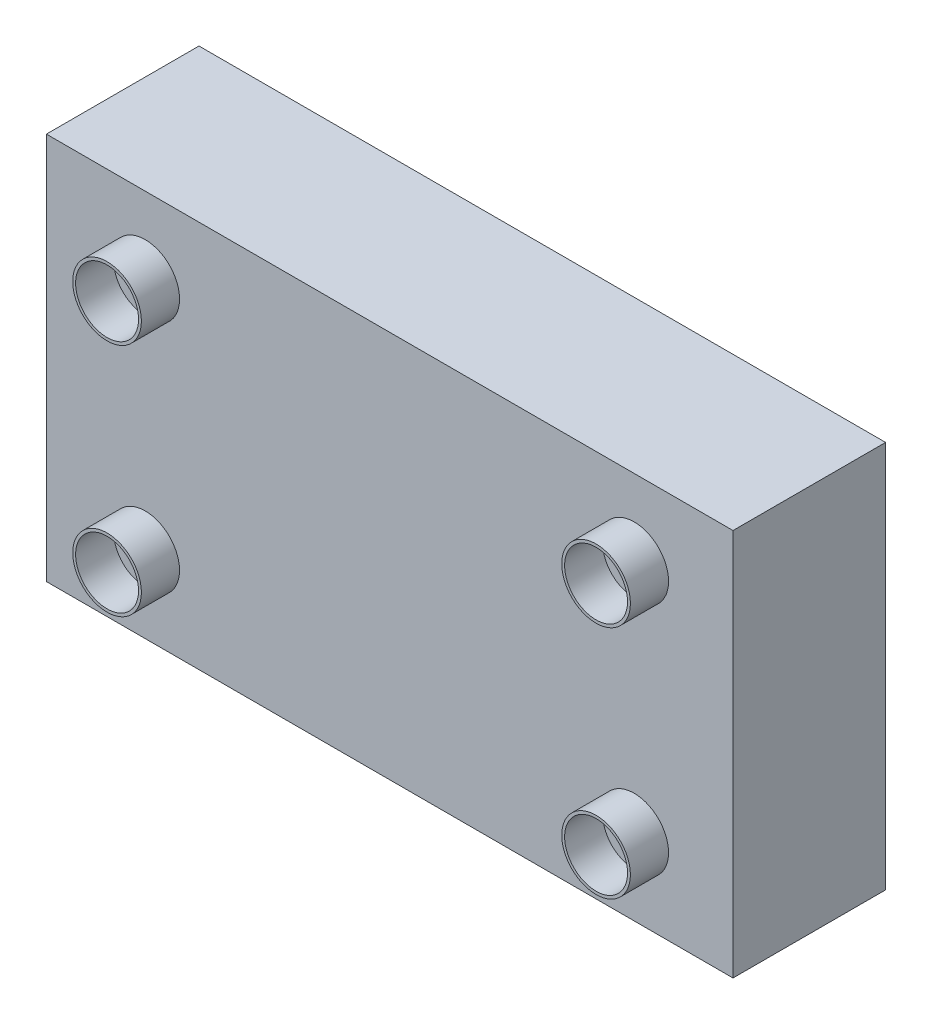
ISO-10303-21;
HEADER;
FILE_DESCRIPTION(('STEP AP214'),'2;1');
FILE_NAME('part.step','',(''),(''),'','','');
FILE_SCHEMA(('AUTOMOTIVE_DESIGN { 1 0 10303 214 1 1 1 1 }'));
ENDSEC;
DATA;
#1=APPLICATION_CONTEXT('core data for automotive mechanical design processes');
#2=APPLICATION_PROTOCOL_DEFINITION('international standard','automotive_design',2000,#1);
#3=PRODUCT_CONTEXT('',#1,'mechanical');
#4=PRODUCT('Part','Part','',(#3));
#5=PRODUCT_RELATED_PRODUCT_CATEGORY('part','',(#4));
#6=PRODUCT_DEFINITION_FORMATION('','',#4);
#7=PRODUCT_DEFINITION_CONTEXT('part definition',#1,'design');
#8=PRODUCT_DEFINITION('design','',#6,#7);
#9=PRODUCT_DEFINITION_SHAPE('','',#8);
#10=(LENGTH_UNIT() NAMED_UNIT(*) SI_UNIT(.MILLI.,.METRE.));
#11=(NAMED_UNIT(*) PLANE_ANGLE_UNIT() SI_UNIT($,.RADIAN.));
#12=(NAMED_UNIT(*) SI_UNIT($,.STERADIAN.) SOLID_ANGLE_UNIT());
#13=UNCERTAINTY_MEASURE_WITH_UNIT(LENGTH_MEASURE(1.E-05),#10,'distance_accuracy_value','');
#14=(GEOMETRIC_REPRESENTATION_CONTEXT(3) GLOBAL_UNCERTAINTY_ASSIGNED_CONTEXT((#13)) GLOBAL_UNIT_ASSIGNED_CONTEXT((#10,
#11,#12)) REPRESENTATION_CONTEXT('',''));
#15=CARTESIAN_POINT('',(0.,0.,0.));
#16=DIRECTION('',(0.,0.,1.));
#17=DIRECTION('',(1.,0.,0.));
#18=AXIS2_PLACEMENT_3D('',#15,#16,#17);
#19=CARTESIAN_POINT('',(-90.,-50.8,40.));
#20=DIRECTION('',(1.,0.,0.));
#21=DIRECTION('',(0.,0.,-1.));
#22=AXIS2_PLACEMENT_3D('',#19,#20,#21);
#23=PLANE('',#22);
#24=DIRECTION('',(0.,-1.,0.));
#25=VECTOR('',#24,1.);
#26=CARTESIAN_POINT('',(-90.,-50.8,0.));
#27=LINE('',#26,#25);
#28=CARTESIAN_POINT('',(-90.,50.8,0.));
#29=VERTEX_POINT('',#28);
#30=CARTESIAN_POINT('',(-90.,-50.8,0.));
#31=VERTEX_POINT('',#30);
#32=EDGE_CURVE('E145',#29,#31,#27,.T.);
#33=ORIENTED_EDGE('',*,*,#32,.T.);
#34=DIRECTION('',(0.,0.,-1.));
#35=VECTOR('',#34,1.);
#36=CARTESIAN_POINT('',(-90.,-50.8,40.));
#37=LINE('',#36,#35);
#38=CARTESIAN_POINT('',(-90.,-50.8,40.));
#39=VERTEX_POINT('',#38);
#40=EDGE_CURVE('E11',#39,#31,#37,.T.);
#41=ORIENTED_EDGE('',*,*,#40,.F.);
#42=DIRECTION('',(0.,-1.,0.));
#43=VECTOR('',#42,1.);
#44=CARTESIAN_POINT('',(-90.,-50.8,40.));
#45=LINE('',#44,#43);
#46=CARTESIAN_POINT('',(-90.,50.8,40.));
#47=VERTEX_POINT('',#46);
#48=EDGE_CURVE('E149',#47,#39,#45,.T.);
#49=ORIENTED_EDGE('',*,*,#48,.F.);
#50=DIRECTION('',(0.,0.,-1.));
#51=VECTOR('',#50,1.);
#52=CARTESIAN_POINT('',(-90.,50.8,40.));
#53=LINE('',#52,#51);
#54=EDGE_CURVE('E155',#47,#29,#53,.T.);
#55=ORIENTED_EDGE('',*,*,#54,.T.);
#56=EDGE_LOOP('',(#33,#41,#49,#55));
#57=FACE_BOUND('',#56,.T.);
#58=ADVANCED_FACE('F33',(#57),#23,.F.);
#59=CARTESIAN_POINT('',(90.,-50.8,40.));
#60=DIRECTION('',(0.,1.,0.));
#61=DIRECTION('',(-1.,0.,0.));
#62=AXIS2_PLACEMENT_3D('',#59,#60,#61);
#63=PLANE('',#62);
#64=DIRECTION('',(1.,0.,0.));
#65=VECTOR('',#64,1.);
#66=CARTESIAN_POINT('',(90.,-50.8,0.));
#67=LINE('',#66,#65);
#68=CARTESIAN_POINT('',(90.,-50.8,0.));
#69=VERTEX_POINT('',#68);
#70=EDGE_CURVE('E158',#31,#69,#67,.T.);
#71=ORIENTED_EDGE('',*,*,#70,.T.);
#72=DIRECTION('',(0.,0.,-1.));
#73=VECTOR('',#72,1.);
#74=CARTESIAN_POINT('',(90.,-50.8,40.));
#75=LINE('',#74,#73);
#76=CARTESIAN_POINT('',(90.,-50.8,40.));
#77=VERTEX_POINT('',#76);
#78=EDGE_CURVE('E40',#77,#69,#75,.T.);
#79=ORIENTED_EDGE('',*,*,#78,.F.);
#80=DIRECTION('',(1.,0.,0.));
#81=VECTOR('',#80,1.);
#82=CARTESIAN_POINT('',(90.,-50.8,40.));
#83=LINE('',#82,#81);
#84=EDGE_CURVE('E84',#39,#77,#83,.T.);
#85=ORIENTED_EDGE('',*,*,#84,.F.);
#86=ORIENTED_EDGE('',*,*,#40,.T.);
#87=EDGE_LOOP('',(#71,#79,#85,#86));
#88=FACE_BOUND('',#87,.T.);
#89=ADVANCED_FACE('F187',(#88),#63,.F.);
#90=CARTESIAN_POINT('',(90.,-50.8,40.));
#91=DIRECTION('',(-1.,0.,0.));
#92=DIRECTION('',(0.,-1.,0.));
#93=AXIS2_PLACEMENT_3D('',#90,#91,#92);
#94=PLANE('',#93);
#95=DIRECTION('',(0.,1.,0.));
#96=VECTOR('',#95,1.);
#97=CARTESIAN_POINT('',(90.,-50.8,0.));
#98=LINE('',#97,#96);
#99=CARTESIAN_POINT('',(90.,50.8,0.));
#100=VERTEX_POINT('',#99);
#101=EDGE_CURVE('E160',#69,#100,#98,.T.);
#102=ORIENTED_EDGE('',*,*,#101,.T.);
#103=DIRECTION('',(0.,0.,-1.));
#104=VECTOR('',#103,1.);
#105=CARTESIAN_POINT('',(90.,50.8,40.));
#106=LINE('',#105,#104);
#107=CARTESIAN_POINT('',(90.,50.8,40.));
#108=VERTEX_POINT('',#107);
#109=EDGE_CURVE('E164',#108,#100,#106,.T.);
#110=ORIENTED_EDGE('',*,*,#109,.F.);
#111=DIRECTION('',(0.,1.,0.));
#112=VECTOR('',#111,1.);
#113=CARTESIAN_POINT('',(90.,-50.8,40.));
#114=LINE('',#113,#112);
#115=EDGE_CURVE('E152',#77,#108,#114,.T.);
#116=ORIENTED_EDGE('',*,*,#115,.F.);
#117=ORIENTED_EDGE('',*,*,#78,.T.);
#118=EDGE_LOOP('',(#102,#110,#116,#117));
#119=FACE_BOUND('',#118,.T.);
#120=ADVANCED_FACE('F169',(#119),#94,.F.);
#121=CARTESIAN_POINT('',(90.,50.8,40.));
#122=DIRECTION('',(0.,-1.,0.));
#123=DIRECTION('',(1.,0.,0.));
#124=AXIS2_PLACEMENT_3D('',#121,#122,#123);
#125=PLANE('',#124);
#126=DIRECTION('',(-1.,0.,0.));
#127=VECTOR('',#126,1.);
#128=CARTESIAN_POINT('',(90.,50.8,0.));
#129=LINE('',#128,#127);
#130=EDGE_CURVE('E77',#100,#29,#129,.T.);
#131=ORIENTED_EDGE('',*,*,#130,.T.);
#132=ORIENTED_EDGE('',*,*,#54,.F.);
#133=DIRECTION('',(-1.,0.,0.));
#134=VECTOR('',#133,1.);
#135=CARTESIAN_POINT('',(90.,50.8,40.));
#136=LINE('',#135,#134);
#137=EDGE_CURVE('E56',#108,#47,#136,.T.);
#138=ORIENTED_EDGE('',*,*,#137,.F.);
#139=ORIENTED_EDGE('',*,*,#109,.T.);
#140=EDGE_LOOP('',(#131,#132,#138,#139));
#141=FACE_BOUND('',#140,.T.);
#142=ADVANCED_FACE('F177',(#141),#125,.F.);
#143=CARTESIAN_POINT('',(0.,0.,40.));
#144=DIRECTION('',(0.,0.,1.));
#145=DIRECTION('',(1.,0.,0.));
#146=AXIS2_PLACEMENT_3D('',#143,#144,#145);
#147=PLANE('',#146);
#148=CARTESIAN_POINT('',(64.1,-30.8,40.));
#149=DIRECTION('',(0.,0.,1.));
#150=DIRECTION('',(1.,0.,0.));
#151=AXIS2_PLACEMENT_3D('',#148,#149,#150);
#152=CIRCLE('',#151,9.);
#153=CARTESIAN_POINT('',(73.1,-30.8,40.));
#154=VERTEX_POINT('',#153);
#155=EDGE_CURVE('E429',#154,#154,#152,.T.);
#156=ORIENTED_EDGE('',*,*,#155,.F.);
#157=EDGE_LOOP('',(#156));
#158=FACE_BOUND('',#157,.T.);
#159=CARTESIAN_POINT('',(64.1,30.8,40.));
#160=DIRECTION('',(0.,0.,1.));
#161=DIRECTION('',(1.,0.,0.));
#162=AXIS2_PLACEMENT_3D('',#159,#160,#161);
#163=CIRCLE('',#162,9.);
#164=CARTESIAN_POINT('',(73.1,30.8,40.));
#165=VERTEX_POINT('',#164);
#166=EDGE_CURVE('E443',#165,#165,#163,.T.);
#167=ORIENTED_EDGE('',*,*,#166,.F.);
#168=EDGE_LOOP('',(#167));
#169=FACE_BOUND('',#168,.T.);
#170=CARTESIAN_POINT('',(-64.1,-30.8,40.));
#171=DIRECTION('',(0.,0.,1.));
#172=DIRECTION('',(1.,0.,0.));
#173=AXIS2_PLACEMENT_3D('',#170,#171,#172);
#174=CIRCLE('',#173,9.);
#175=CARTESIAN_POINT('',(-55.1,-30.8,40.));
#176=VERTEX_POINT('',#175);
#177=EDGE_CURVE('E448',#176,#176,#174,.T.);
#178=ORIENTED_EDGE('',*,*,#177,.F.);
#179=EDGE_LOOP('',(#178));
#180=FACE_BOUND('',#179,.T.);
#181=CARTESIAN_POINT('',(-64.1,30.8,40.));
#182=DIRECTION('',(0.,0.,1.));
#183=DIRECTION('',(1.,0.,0.));
#184=AXIS2_PLACEMENT_3D('',#181,#182,#183);
#185=CIRCLE('',#184,9.);
#186=CARTESIAN_POINT('',(-55.1,30.8,40.));
#187=VERTEX_POINT('',#186);
#188=EDGE_CURVE('E132',#187,#187,#185,.T.);
#189=ORIENTED_EDGE('',*,*,#188,.F.);
#190=EDGE_LOOP('',(#189));
#191=FACE_BOUND('',#190,.T.);
#192=ORIENTED_EDGE('',*,*,#48,.T.);
#193=ORIENTED_EDGE('',*,*,#84,.T.);
#194=ORIENTED_EDGE('',*,*,#115,.T.);
#195=ORIENTED_EDGE('',*,*,#137,.T.);
#196=EDGE_LOOP('',(#192,#193,#194,#195));
#197=FACE_BOUND('',#196,.T.);
#198=ADVANCED_FACE('F179',(#158,#169,#180,#191,#197),#147,.T.);
#199=CARTESIAN_POINT('',(0.,0.,0.));
#200=DIRECTION('',(0.,0.,1.));
#201=DIRECTION('',(1.,0.,0.));
#202=AXIS2_PLACEMENT_3D('',#199,#200,#201);
#203=PLANE('',#202);
#204=DIRECTION('',(-1.,0.,0.));
#205=VECTOR('',#204,1.);
#206=CARTESIAN_POINT('',(-79.9999999999999,-40.8,0.));
#207=LINE('',#206,#205);
#208=CARTESIAN_POINT('',(80.,-40.8,0.));
#209=VERTEX_POINT('',#208);
#210=CARTESIAN_POINT('',(-79.9999999999999,-40.8,0.));
#211=VERTEX_POINT('',#210);
#212=EDGE_CURVE('E138',#209,#211,#207,.T.);
#213=ORIENTED_EDGE('',*,*,#212,.F.);
#214=DIRECTION('',(0.,-1.,0.));
#215=VECTOR('',#214,1.);
#216=CARTESIAN_POINT('',(80.,-40.8,0.));
#217=LINE('',#216,#215);
#218=CARTESIAN_POINT('',(80.,40.8,0.));
#219=VERTEX_POINT('',#218);
#220=EDGE_CURVE('E47',#219,#209,#217,.T.);
#221=ORIENTED_EDGE('',*,*,#220,.F.);
#222=DIRECTION('',(1.,0.,0.));
#223=VECTOR('',#222,1.);
#224=CARTESIAN_POINT('',(-79.9999999999999,40.8,0.));
#225=LINE('',#224,#223);
#226=CARTESIAN_POINT('',(-79.9999999999999,40.8,0.));
#227=VERTEX_POINT('',#226);
#228=EDGE_CURVE('E126',#227,#219,#225,.T.);
#229=ORIENTED_EDGE('',*,*,#228,.F.);
#230=DIRECTION('',(0.,1.,0.));
#231=VECTOR('',#230,1.);
#232=CARTESIAN_POINT('',(-79.9999999999999,-40.8,0.));
#233=LINE('',#232,#231);
#234=EDGE_CURVE('E129',#211,#227,#233,.T.);
#235=ORIENTED_EDGE('',*,*,#234,.F.);
#236=EDGE_LOOP('',(#213,#221,#229,#235));
#237=FACE_BOUND('',#236,.T.);
#238=ORIENTED_EDGE('',*,*,#32,.F.);
#239=ORIENTED_EDGE('',*,*,#130,.F.);
#240=ORIENTED_EDGE('',*,*,#101,.F.);
#241=ORIENTED_EDGE('',*,*,#70,.F.);
#242=EDGE_LOOP('',(#238,#239,#240,#241));
#243=FACE_BOUND('',#242,.T.);
#244=ADVANCED_FACE('F173',(#237,#243),#203,.F.);
#245=CARTESIAN_POINT('',(80.,-40.8,5.));
#246=DIRECTION('',(1.,0.,0.));
#247=DIRECTION('',(0.,0.,-1.));
#248=AXIS2_PLACEMENT_3D('',#245,#246,#247);
#249=PLANE('',#248);
#250=ORIENTED_EDGE('',*,*,#220,.T.);
#251=DIRECTION('',(0.,0.,-1.));
#252=VECTOR('',#251,1.);
#253=CARTESIAN_POINT('',(80.,-40.8,5.));
#254=LINE('',#253,#252);
#255=CARTESIAN_POINT('',(80.,-40.8,5.));
#256=VERTEX_POINT('',#255);
#257=EDGE_CURVE('E104',#256,#209,#254,.T.);
#258=ORIENTED_EDGE('',*,*,#257,.F.);
#259=DIRECTION('',(0.,-1.,0.));
#260=VECTOR('',#259,1.);
#261=CARTESIAN_POINT('',(80.,-40.8,5.));
#262=LINE('',#261,#260);
#263=CARTESIAN_POINT('',(80.,40.8,5.));
#264=VERTEX_POINT('',#263);
#265=EDGE_CURVE('E108',#264,#256,#262,.T.);
#266=ORIENTED_EDGE('',*,*,#265,.F.);
#267=DIRECTION('',(0.,0.,-1.));
#268=VECTOR('',#267,1.);
#269=CARTESIAN_POINT('',(80.,40.8,5.));
#270=LINE('',#269,#268);
#271=EDGE_CURVE('E143',#264,#219,#270,.T.);
#272=ORIENTED_EDGE('',*,*,#271,.T.);
#273=EDGE_LOOP('',(#250,#258,#266,#272));
#274=FACE_BOUND('',#273,.T.);
#275=ADVANCED_FACE('F106',(#274),#249,.F.);
#276=CARTESIAN_POINT('',(-79.9999999999999,40.8,5.));
#277=DIRECTION('',(0.,1.,0.));
#278=DIRECTION('',(0.,0.,1.));
#279=AXIS2_PLACEMENT_3D('',#276,#277,#278);
#280=PLANE('',#279);
#281=ORIENTED_EDGE('',*,*,#228,.T.);
#282=ORIENTED_EDGE('',*,*,#271,.F.);
#283=DIRECTION('',(1.,0.,0.));
#284=VECTOR('',#283,1.);
#285=CARTESIAN_POINT('',(-79.9999999999999,40.8,5.));
#286=LINE('',#285,#284);
#287=CARTESIAN_POINT('',(-79.9999999999999,40.8,5.));
#288=VERTEX_POINT('',#287);
#289=EDGE_CURVE('E114',#288,#264,#286,.T.);
#290=ORIENTED_EDGE('',*,*,#289,.F.);
#291=DIRECTION('',(0.,0.,-1.));
#292=VECTOR('',#291,1.);
#293=CARTESIAN_POINT('',(-79.9999999999999,40.8,5.));
#294=LINE('',#293,#292);
#295=EDGE_CURVE('E146',#288,#227,#294,.T.);
#296=ORIENTED_EDGE('',*,*,#295,.T.);
#297=EDGE_LOOP('',(#281,#282,#290,#296));
#298=FACE_BOUND('',#297,.T.);
#299=ADVANCED_FACE('F222',(#298),#280,.F.);
#300=CARTESIAN_POINT('',(-79.9999999999999,-40.8,5.));
#301=DIRECTION('',(-1.,0.,0.));
#302=DIRECTION('',(0.,0.,1.));
#303=AXIS2_PLACEMENT_3D('',#300,#301,#302);
#304=PLANE('',#303);
#305=ORIENTED_EDGE('',*,*,#234,.T.);
#306=ORIENTED_EDGE('',*,*,#295,.F.);
#307=DIRECTION('',(0.,1.,0.));
#308=VECTOR('',#307,1.);
#309=CARTESIAN_POINT('',(-79.9999999999999,-40.8,5.));
#310=LINE('',#309,#308);
#311=CARTESIAN_POINT('',(-79.9999999999999,-40.8,5.));
#312=VERTEX_POINT('',#311);
#313=EDGE_CURVE('E122',#312,#288,#310,.T.);
#314=ORIENTED_EDGE('',*,*,#313,.F.);
#315=DIRECTION('',(0.,0.,-1.));
#316=VECTOR('',#315,1.);
#317=CARTESIAN_POINT('',(-79.9999999999999,-40.8,5.));
#318=LINE('',#317,#316);
#319=EDGE_CURVE('E113',#312,#211,#318,.T.);
#320=ORIENTED_EDGE('',*,*,#319,.T.);
#321=EDGE_LOOP('',(#305,#306,#314,#320));
#322=FACE_BOUND('',#321,.T.);
#323=ADVANCED_FACE('F231',(#322),#304,.F.);
#324=CARTESIAN_POINT('',(-79.9999999999999,-40.8,5.));
#325=DIRECTION('',(0.,-1.,0.));
#326=DIRECTION('',(0.,0.,-1.));
#327=AXIS2_PLACEMENT_3D('',#324,#325,#326);
#328=PLANE('',#327);
#329=ORIENTED_EDGE('',*,*,#212,.T.);
#330=ORIENTED_EDGE('',*,*,#319,.F.);
#331=DIRECTION('',(-1.,0.,0.));
#332=VECTOR('',#331,1.);
#333=CARTESIAN_POINT('',(-79.9999999999999,-40.8,5.));
#334=LINE('',#333,#332);
#335=EDGE_CURVE('E117',#256,#312,#334,.T.);
#336=ORIENTED_EDGE('',*,*,#335,.F.);
#337=ORIENTED_EDGE('',*,*,#257,.T.);
#338=EDGE_LOOP('',(#329,#330,#336,#337));
#339=FACE_BOUND('',#338,.T.);
#340=ADVANCED_FACE('F118',(#339),#328,.F.);
#341=CARTESIAN_POINT('',(0.,0.,5.));
#342=DIRECTION('',(0.,0.,-1.));
#343=DIRECTION('',(-1.,0.,0.));
#344=AXIS2_PLACEMENT_3D('',#341,#342,#343);
#345=PLANE('',#344);
#346=ORIENTED_EDGE('',*,*,#265,.T.);
#347=ORIENTED_EDGE('',*,*,#335,.T.);
#348=ORIENTED_EDGE('',*,*,#313,.T.);
#349=ORIENTED_EDGE('',*,*,#289,.T.);
#350=EDGE_LOOP('',(#346,#347,#348,#349));
#351=FACE_BOUND('',#350,.T.);
#352=ADVANCED_FACE('F124',(#351),#345,.T.);
#353=CARTESIAN_POINT('',(-64.1,30.8,50.));
#354=DIRECTION('',(0.,0.,-1.));
#355=DIRECTION('',(-1.,0.,0.));
#356=AXIS2_PLACEMENT_3D('',#353,#354,#355);
#357=CYLINDRICAL_SURFACE('',#356,9.);
#358=CARTESIAN_POINT('',(-64.1,30.8,50.));
#359=DIRECTION('',(0.,0.,1.));
#360=DIRECTION('',(1.,0.,0.));
#361=AXIS2_PLACEMENT_3D('',#358,#359,#360);
#362=CIRCLE('',#361,9.);
#363=CARTESIAN_POINT('',(-55.1,30.8,50.));
#364=VERTEX_POINT('',#363);
#365=EDGE_CURVE('E139',#364,#364,#362,.T.);
#366=ORIENTED_EDGE('',*,*,#365,.F.);
#367=EDGE_LOOP('',(#366));
#368=FACE_BOUND('',#367,.T.);
#369=ORIENTED_EDGE('',*,*,#188,.T.);
#370=EDGE_LOOP('',(#369));
#371=FACE_BOUND('',#370,.T.);
#372=ADVANCED_FACE('F258',(#368,#371),#357,.T.);
#373=CARTESIAN_POINT('',(-64.1,30.8,50.));
#374=DIRECTION('',(0.,0.,1.));
#375=DIRECTION('',(1.,0.,0.));
#376=AXIS2_PLACEMENT_3D('',#373,#374,#375);
#377=PLANE('',#376);
#378=CARTESIAN_POINT('',(-64.1,30.8,50.));
#379=DIRECTION('',(0.,0.,1.));
#380=DIRECTION('',(1.,0.,0.));
#381=AXIS2_PLACEMENT_3D('',#378,#379,#380);
#382=CIRCLE('',#381,8.25);
#383=CARTESIAN_POINT('',(-55.85,30.8,50.));
#384=VERTEX_POINT('',#383);
#385=EDGE_CURVE('E430',#384,#384,#382,.T.);
#386=ORIENTED_EDGE('',*,*,#385,.F.);
#387=EDGE_LOOP('',(#386));
#388=FACE_BOUND('',#387,.T.);
#389=ORIENTED_EDGE('',*,*,#365,.T.);
#390=EDGE_LOOP('',(#389));
#391=FACE_BOUND('',#390,.T.);
#392=ADVANCED_FACE('F272',(#388,#391),#377,.T.);
#393=CARTESIAN_POINT('',(-64.1,-30.8,50.));
#394=DIRECTION('',(0.,0.,-1.));
#395=DIRECTION('',(-1.,0.,0.));
#396=AXIS2_PLACEMENT_3D('',#393,#394,#395);
#397=CYLINDRICAL_SURFACE('',#396,9.);
#398=CARTESIAN_POINT('',(-64.1,-30.8,50.));
#399=DIRECTION('',(0.,0.,1.));
#400=DIRECTION('',(1.,0.,0.));
#401=AXIS2_PLACEMENT_3D('',#398,#399,#400);
#402=CIRCLE('',#401,9.);
#403=CARTESIAN_POINT('',(-55.1,-30.8,50.));
#404=VERTEX_POINT('',#403);
#405=EDGE_CURVE('E451',#404,#404,#402,.T.);
#406=ORIENTED_EDGE('',*,*,#405,.F.);
#407=EDGE_LOOP('',(#406));
#408=FACE_BOUND('',#407,.T.);
#409=ORIENTED_EDGE('',*,*,#177,.T.);
#410=EDGE_LOOP('',(#409));
#411=FACE_BOUND('',#410,.T.);
#412=ADVANCED_FACE('F280',(#408,#411),#397,.T.);
#413=CARTESIAN_POINT('',(-64.1,-30.8,50.));
#414=DIRECTION('',(0.,0.,1.));
#415=DIRECTION('',(1.,0.,0.));
#416=AXIS2_PLACEMENT_3D('',#413,#414,#415);
#417=PLANE('',#416);
#418=CARTESIAN_POINT('',(-64.1,-30.8,50.));
#419=DIRECTION('',(0.,0.,1.));
#420=DIRECTION('',(1.,0.,0.));
#421=AXIS2_PLACEMENT_3D('',#418,#419,#420);
#422=CIRCLE('',#421,8.25);
#423=CARTESIAN_POINT('',(-55.85,-30.8,50.));
#424=VERTEX_POINT('',#423);
#425=EDGE_CURVE('E439',#424,#424,#422,.T.);
#426=ORIENTED_EDGE('',*,*,#425,.F.);
#427=EDGE_LOOP('',(#426));
#428=FACE_BOUND('',#427,.T.);
#429=ORIENTED_EDGE('',*,*,#405,.T.);
#430=EDGE_LOOP('',(#429));
#431=FACE_BOUND('',#430,.T.);
#432=ADVANCED_FACE('F285',(#428,#431),#417,.T.);
#433=CARTESIAN_POINT('',(64.1,30.8,50.));
#434=DIRECTION('',(0.,0.,-1.));
#435=DIRECTION('',(-1.,0.,0.));
#436=AXIS2_PLACEMENT_3D('',#433,#434,#435);
#437=CYLINDRICAL_SURFACE('',#436,9.);
#438=CARTESIAN_POINT('',(64.1,30.8,50.));
#439=DIRECTION('',(0.,0.,1.));
#440=DIRECTION('',(1.,0.,0.));
#441=AXIS2_PLACEMENT_3D('',#438,#439,#440);
#442=CIRCLE('',#441,9.);
#443=CARTESIAN_POINT('',(73.1,30.8,50.));
#444=VERTEX_POINT('',#443);
#445=EDGE_CURVE('E445',#444,#444,#442,.T.);
#446=ORIENTED_EDGE('',*,*,#445,.F.);
#447=EDGE_LOOP('',(#446));
#448=FACE_BOUND('',#447,.T.);
#449=ORIENTED_EDGE('',*,*,#166,.T.);
#450=EDGE_LOOP('',(#449));
#451=FACE_BOUND('',#450,.T.);
#452=ADVANCED_FACE('F293',(#448,#451),#437,.T.);
#453=CARTESIAN_POINT('',(64.1,30.8,50.));
#454=DIRECTION('',(0.,0.,1.));
#455=DIRECTION('',(1.,0.,0.));
#456=AXIS2_PLACEMENT_3D('',#453,#454,#455);
#457=PLANE('',#456);
#458=CARTESIAN_POINT('',(64.1,30.8,50.));
#459=DIRECTION('',(0.,0.,1.));
#460=DIRECTION('',(1.,0.,0.));
#461=AXIS2_PLACEMENT_3D('',#458,#459,#460);
#462=CIRCLE('',#461,8.25000000000001);
#463=CARTESIAN_POINT('',(72.35,30.8,50.));
#464=VERTEX_POINT('',#463);
#465=EDGE_CURVE('E486',#464,#464,#462,.T.);
#466=ORIENTED_EDGE('',*,*,#465,.F.);
#467=EDGE_LOOP('',(#466));
#468=FACE_BOUND('',#467,.T.);
#469=ORIENTED_EDGE('',*,*,#445,.T.);
#470=EDGE_LOOP('',(#469));
#471=FACE_BOUND('',#470,.T.);
#472=ADVANCED_FACE('F298',(#468,#471),#457,.T.);
#473=CARTESIAN_POINT('',(64.1,-30.8,50.));
#474=DIRECTION('',(0.,0.,-1.));
#475=DIRECTION('',(-1.,0.,0.));
#476=AXIS2_PLACEMENT_3D('',#473,#474,#475);
#477=CYLINDRICAL_SURFACE('',#476,9.);
#478=CARTESIAN_POINT('',(64.1,-30.8,50.));
#479=DIRECTION('',(0.,0.,1.));
#480=DIRECTION('',(1.,0.,0.));
#481=AXIS2_PLACEMENT_3D('',#478,#479,#480);
#482=CIRCLE('',#481,9.);
#483=CARTESIAN_POINT('',(73.1,-30.8,50.));
#484=VERTEX_POINT('',#483);
#485=EDGE_CURVE('E433',#484,#484,#482,.T.);
#486=ORIENTED_EDGE('',*,*,#485,.F.);
#487=EDGE_LOOP('',(#486));
#488=FACE_BOUND('',#487,.T.);
#489=ORIENTED_EDGE('',*,*,#155,.T.);
#490=EDGE_LOOP('',(#489));
#491=FACE_BOUND('',#490,.T.);
#492=ADVANCED_FACE('F306',(#488,#491),#477,.T.);
#493=CARTESIAN_POINT('',(64.1,-30.8,50.));
#494=DIRECTION('',(0.,0.,1.));
#495=DIRECTION('',(1.,0.,0.));
#496=AXIS2_PLACEMENT_3D('',#493,#494,#495);
#497=PLANE('',#496);
#498=CARTESIAN_POINT('',(64.1,-30.8,50.));
#499=DIRECTION('',(0.,0.,1.));
#500=DIRECTION('',(1.,0.,0.));
#501=AXIS2_PLACEMENT_3D('',#498,#499,#500);
#502=CIRCLE('',#501,8.25000000000001);
#503=CARTESIAN_POINT('',(72.35,-30.8,50.));
#504=VERTEX_POINT('',#503);
#505=EDGE_CURVE('E480',#504,#504,#502,.T.);
#506=ORIENTED_EDGE('',*,*,#505,.F.);
#507=EDGE_LOOP('',(#506));
#508=FACE_BOUND('',#507,.T.);
#509=ORIENTED_EDGE('',*,*,#485,.T.);
#510=EDGE_LOOP('',(#509));
#511=FACE_BOUND('',#510,.T.);
#512=ADVANCED_FACE('F311',(#508,#511),#497,.T.);
#513=CARTESIAN_POINT('',(64.1,-30.8,40.));
#514=DIRECTION('',(0.,0.,1.));
#515=DIRECTION('',(1.,0.,0.));
#516=AXIS2_PLACEMENT_3D('',#513,#514,#515);
#517=CYLINDRICAL_SURFACE('',#516,8.25000000000001);
#518=CARTESIAN_POINT('',(64.1,-30.8,40.));
#519=DIRECTION('',(0.,0.,1.));
#520=DIRECTION('',(1.,0.,0.));
#521=AXIS2_PLACEMENT_3D('',#518,#519,#520);
#522=CIRCLE('',#521,8.25000000000001);
#523=CARTESIAN_POINT('',(72.35,-30.8,40.));
#524=VERTEX_POINT('',#523);
#525=EDGE_CURVE('E483',#524,#524,#522,.T.);
#526=ORIENTED_EDGE('',*,*,#525,.F.);
#527=EDGE_LOOP('',(#526));
#528=FACE_BOUND('',#527,.T.);
#529=ORIENTED_EDGE('',*,*,#505,.T.);
#530=EDGE_LOOP('',(#529));
#531=FACE_BOUND('',#530,.T.);
#532=ADVANCED_FACE('F342',(#528,#531),#517,.F.);
#533=CARTESIAN_POINT('',(64.1,-30.8,40.));
#534=DIRECTION('',(0.,0.,1.));
#535=DIRECTION('',(1.,0.,0.));
#536=AXIS2_PLACEMENT_3D('',#533,#534,#535);
#537=PLANE('',#536);
#538=ORIENTED_EDGE('',*,*,#525,.T.);
#539=EDGE_LOOP('',(#538));
#540=FACE_BOUND('',#539,.T.);
#541=ADVANCED_FACE('F352',(#540),#537,.T.);
#542=CARTESIAN_POINT('',(64.1,30.8,40.));
#543=DIRECTION('',(0.,0.,1.));
#544=DIRECTION('',(1.,0.,0.));
#545=AXIS2_PLACEMENT_3D('',#542,#543,#544);
#546=CYLINDRICAL_SURFACE('',#545,8.25000000000001);
#547=CARTESIAN_POINT('',(64.1,30.8,40.));
#548=DIRECTION('',(0.,0.,1.));
#549=DIRECTION('',(1.,0.,0.));
#550=AXIS2_PLACEMENT_3D('',#547,#548,#549);
#551=CIRCLE('',#550,8.25000000000001);
#552=CARTESIAN_POINT('',(72.35,30.8,40.));
#553=VERTEX_POINT('',#552);
#554=EDGE_CURVE('E436',#553,#553,#551,.T.);
#555=ORIENTED_EDGE('',*,*,#554,.F.);
#556=EDGE_LOOP('',(#555));
#557=FACE_BOUND('',#556,.T.);
#558=ORIENTED_EDGE('',*,*,#465,.T.);
#559=EDGE_LOOP('',(#558));
#560=FACE_BOUND('',#559,.T.);
#561=ADVANCED_FACE('F362',(#557,#560),#546,.F.);
#562=CARTESIAN_POINT('',(64.1,30.8,40.));
#563=DIRECTION('',(0.,0.,1.));
#564=DIRECTION('',(1.,0.,0.));
#565=AXIS2_PLACEMENT_3D('',#562,#563,#564);
#566=PLANE('',#565);
#567=ORIENTED_EDGE('',*,*,#554,.T.);
#568=EDGE_LOOP('',(#567));
#569=FACE_BOUND('',#568,.T.);
#570=ADVANCED_FACE('F372',(#569),#566,.T.);
#571=CARTESIAN_POINT('',(-64.1,-30.8,40.));
#572=DIRECTION('',(0.,0.,1.));
#573=DIRECTION('',(1.,0.,0.));
#574=AXIS2_PLACEMENT_3D('',#571,#572,#573);
#575=CYLINDRICAL_SURFACE('',#574,8.25);
#576=CARTESIAN_POINT('',(-64.1,-30.8,40.));
#577=DIRECTION('',(0.,0.,1.));
#578=DIRECTION('',(1.,0.,0.));
#579=AXIS2_PLACEMENT_3D('',#576,#577,#578);
#580=CIRCLE('',#579,8.25);
#581=CARTESIAN_POINT('',(-55.85,-30.8,40.));
#582=VERTEX_POINT('',#581);
#583=EDGE_CURVE('E477',#582,#582,#580,.T.);
#584=ORIENTED_EDGE('',*,*,#583,.F.);
#585=EDGE_LOOP('',(#584));
#586=FACE_BOUND('',#585,.T.);
#587=ORIENTED_EDGE('',*,*,#425,.T.);
#588=EDGE_LOOP('',(#587));
#589=FACE_BOUND('',#588,.T.);
#590=ADVANCED_FACE('F382',(#586,#589),#575,.F.);
#591=CARTESIAN_POINT('',(-64.1,-30.8,40.));
#592=DIRECTION('',(0.,0.,1.));
#593=DIRECTION('',(1.,0.,0.));
#594=AXIS2_PLACEMENT_3D('',#591,#592,#593);
#595=PLANE('',#594);
#596=ORIENTED_EDGE('',*,*,#583,.T.);
#597=EDGE_LOOP('',(#596));
#598=FACE_BOUND('',#597,.T.);
#599=ADVANCED_FACE('F392',(#598),#595,.T.);
#600=CARTESIAN_POINT('',(-64.1,30.8,40.));
#601=DIRECTION('',(0.,0.,1.));
#602=DIRECTION('',(1.,0.,0.));
#603=AXIS2_PLACEMENT_3D('',#600,#601,#602);
#604=CYLINDRICAL_SURFACE('',#603,8.25);
#605=CARTESIAN_POINT('',(-64.1,30.8,40.));
#606=DIRECTION('',(0.,0.,1.));
#607=DIRECTION('',(1.,0.,0.));
#608=AXIS2_PLACEMENT_3D('',#605,#606,#607);
#609=CIRCLE('',#608,8.25);
#610=CARTESIAN_POINT('',(-55.85,30.8,40.));
#611=VERTEX_POINT('',#610);
#612=EDGE_CURVE('E428',#611,#611,#609,.T.);
#613=ORIENTED_EDGE('',*,*,#612,.F.);
#614=EDGE_LOOP('',(#613));
#615=FACE_BOUND('',#614,.T.);
#616=ORIENTED_EDGE('',*,*,#385,.T.);
#617=EDGE_LOOP('',(#616));
#618=FACE_BOUND('',#617,.T.);
#619=ADVANCED_FACE('F402',(#615,#618),#604,.F.);
#620=CARTESIAN_POINT('',(-64.1,30.8,40.));
#621=DIRECTION('',(0.,0.,1.));
#622=DIRECTION('',(1.,0.,0.));
#623=AXIS2_PLACEMENT_3D('',#620,#621,#622);
#624=PLANE('',#623);
#625=ORIENTED_EDGE('',*,*,#612,.T.);
#626=EDGE_LOOP('',(#625));
#627=FACE_BOUND('',#626,.T.);
#628=ADVANCED_FACE('F412',(#627),#624,.T.);
#629=CLOSED_SHELL('',(#58,#89,#120,#142,#198,#244,#275,#299,#323,#340,#352,#372,#392,#412,#432,
#452,#472,#492,#512,#532,#541,#561,#570,#590,#599,#619,#628));
#630=MANIFOLD_SOLID_BREP('B2',#629);
#631=ADVANCED_BREP_SHAPE_REPRESENTATION('',(#18,#630),#14);
#632=SHAPE_DEFINITION_REPRESENTATION(#9,#631);
ENDSEC;
END-ISO-10303-21;
